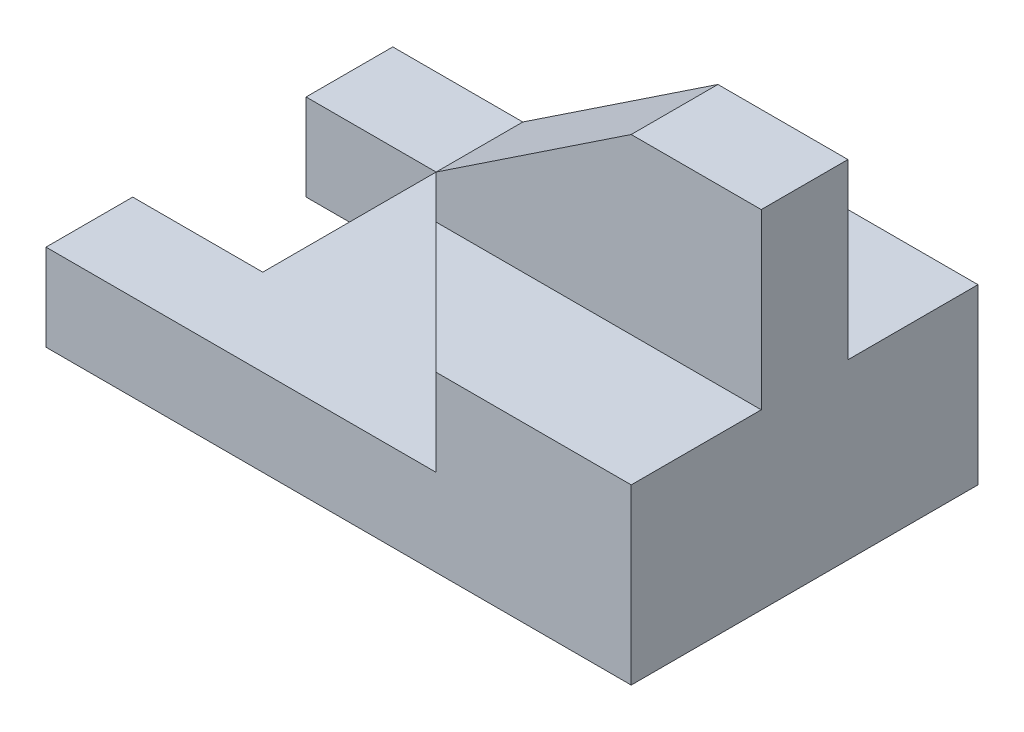
ISO-10303-21;
HEADER;
FILE_DESCRIPTION(('STEP AP214'),'2;1');
FILE_NAME('part.step','',(''),(''),'','','');
FILE_SCHEMA(('AUTOMOTIVE_DESIGN { 1 0 10303 214 1 1 1 1 }'));
ENDSEC;
DATA;
#1=APPLICATION_CONTEXT('core data for automotive mechanical design processes');
#2=APPLICATION_PROTOCOL_DEFINITION('international standard','automotive_design',2000,#1);
#3=PRODUCT_CONTEXT('',#1,'mechanical');
#4=PRODUCT('Part','Part','',(#3));
#5=PRODUCT_RELATED_PRODUCT_CATEGORY('part','',(#4));
#6=PRODUCT_DEFINITION_FORMATION('','',#4);
#7=PRODUCT_DEFINITION_CONTEXT('part definition',#1,'design');
#8=PRODUCT_DEFINITION('design','',#6,#7);
#9=PRODUCT_DEFINITION_SHAPE('','',#8);
#10=(LENGTH_UNIT() NAMED_UNIT(*) SI_UNIT(.MILLI.,.METRE.));
#11=(NAMED_UNIT(*) PLANE_ANGLE_UNIT() SI_UNIT($,.RADIAN.));
#12=(NAMED_UNIT(*) SI_UNIT($,.STERADIAN.) SOLID_ANGLE_UNIT());
#13=UNCERTAINTY_MEASURE_WITH_UNIT(LENGTH_MEASURE(1.E-05),#10,'distance_accuracy_value','');
#14=(GEOMETRIC_REPRESENTATION_CONTEXT(3) GLOBAL_UNCERTAINTY_ASSIGNED_CONTEXT((#13)) GLOBAL_UNIT_ASSIGNED_CONTEXT((#10,
#11,#12)) REPRESENTATION_CONTEXT('',''));
#15=CARTESIAN_POINT('',(0.,0.,0.));
#16=DIRECTION('',(0.,0.,1.));
#17=DIRECTION('',(1.,0.,0.));
#18=AXIS2_PLACEMENT_3D('',#15,#16,#17);
#19=CARTESIAN_POINT('',(0.,4.,0.));
#20=DIRECTION('',(0.,1.,0.));
#21=DIRECTION('',(0.,0.,1.));
#22=AXIS2_PLACEMENT_3D('',#19,#20,#21);
#23=PLANE('',#22);
#24=DIRECTION('',(-0.707106781186547,0.,0.707106781186548));
#25=VECTOR('',#24,1.);
#26=CARTESIAN_POINT('',(2.25,4.,-4.));
#27=LINE('',#26,#25);
#28=CARTESIAN_POINT('',(2.25,4.,-4.));
#29=VERTEX_POINT('',#28);
#30=CARTESIAN_POINT('',(-0.749999999999999,4.,-1.));
#31=VERTEX_POINT('',#30);
#32=EDGE_CURVE('E200',#29,#31,#27,.T.);
#33=ORIENTED_EDGE('',*,*,#32,.T.);
#34=DIRECTION('',(1.,0.,0.));
#35=VECTOR('',#34,1.);
#36=CARTESIAN_POINT('',(6.75,4.,-1.));
#37=LINE('',#36,#35);
#38=CARTESIAN_POINT('',(6.75,4.,-1.));
#39=VERTEX_POINT('',#38);
#40=EDGE_CURVE('E50',#31,#39,#37,.T.);
#41=ORIENTED_EDGE('',*,*,#40,.T.);
#42=DIRECTION('',(0.,0.,-1.));
#43=VECTOR('',#42,1.);
#44=CARTESIAN_POINT('',(6.75,4.,4.));
#45=LINE('',#44,#43);
#46=CARTESIAN_POINT('',(6.75,4.,-4.));
#47=VERTEX_POINT('',#46);
#48=EDGE_CURVE('E159',#39,#47,#45,.T.);
#49=ORIENTED_EDGE('',*,*,#48,.T.);
#50=DIRECTION('',(-1.,0.,0.));
#51=VECTOR('',#50,1.);
#52=CARTESIAN_POINT('',(6.75,4.,-4.));
#53=LINE('',#52,#51);
#54=EDGE_CURVE('E158',#47,#29,#53,.T.);
#55=ORIENTED_EDGE('',*,*,#54,.T.);
#56=EDGE_LOOP('',(#33,#41,#49,#55));
#57=FACE_BOUND('',#56,.T.);
#58=ADVANCED_FACE('F35',(#57),#23,.T.);
#59=CARTESIAN_POINT('',(0.,2.,-2.));
#60=DIRECTION('',(0.,0.,-1.));
#61=DIRECTION('',(-1.,0.,0.));
#62=AXIS2_PLACEMENT_3D('',#59,#60,#61);
#63=PLANE('',#62);
#64=DIRECTION('',(1.,0.,0.));
#65=VECTOR('',#64,1.);
#66=CARTESIAN_POINT('',(0.,0.,-2.));
#67=LINE('',#66,#65);
#68=CARTESIAN_POINT('',(-6.75,0.,-2.));
#69=VERTEX_POINT('',#68);
#70=CARTESIAN_POINT('',(-3.75,0.,-2.));
#71=VERTEX_POINT('',#70);
#72=EDGE_CURVE('E222',#69,#71,#67,.T.);
#73=ORIENTED_EDGE('',*,*,#72,.T.);
#74=DIRECTION('',(0.,-1.,0.));
#75=VECTOR('',#74,1.);
#76=CARTESIAN_POINT('',(-3.75,2.,-2.));
#77=LINE('',#76,#75);
#78=CARTESIAN_POINT('',(-3.75,2.,-2.));
#79=VERTEX_POINT('',#78);
#80=EDGE_CURVE('E11',#79,#71,#77,.T.);
#81=ORIENTED_EDGE('',*,*,#80,.F.);
#82=DIRECTION('',(1.,0.,0.));
#83=VECTOR('',#82,1.);
#84=CARTESIAN_POINT('',(0.,2.,-2.));
#85=LINE('',#84,#83);
#86=CARTESIAN_POINT('',(-6.75,2.,-2.));
#87=VERTEX_POINT('',#86);
#88=EDGE_CURVE('E223',#87,#79,#85,.T.);
#89=ORIENTED_EDGE('',*,*,#88,.F.);
#90=DIRECTION('',(0.,-1.,0.));
#91=VECTOR('',#90,1.);
#92=CARTESIAN_POINT('',(-6.75,2.,-2.));
#93=LINE('',#92,#91);
#94=EDGE_CURVE('E259',#87,#69,#93,.T.);
#95=ORIENTED_EDGE('',*,*,#94,.T.);
#96=EDGE_LOOP('',(#73,#81,#89,#95));
#97=FACE_BOUND('',#96,.T.);
#98=ADVANCED_FACE('F37',(#97),#63,.F.);
#99=CARTESIAN_POINT('',(-3.75,2.,0.));
#100=DIRECTION('',(1.,0.,0.));
#101=DIRECTION('',(0.,0.,-1.));
#102=AXIS2_PLACEMENT_3D('',#99,#100,#101);
#103=PLANE('',#102);
#104=DIRECTION('',(0.,0.,1.));
#105=VECTOR('',#104,1.);
#106=CARTESIAN_POINT('',(-3.75,0.,0.));
#107=LINE('',#106,#105);
#108=CARTESIAN_POINT('',(-3.75,0.,2.));
#109=VERTEX_POINT('',#108);
#110=EDGE_CURVE('E243',#71,#109,#107,.T.);
#111=ORIENTED_EDGE('',*,*,#110,.T.);
#112=DIRECTION('',(0.,-1.,0.));
#113=VECTOR('',#112,1.);
#114=CARTESIAN_POINT('',(-3.75,2.,2.));
#115=LINE('',#114,#113);
#116=CARTESIAN_POINT('',(-3.75,2.,2.));
#117=VERTEX_POINT('',#116);
#118=EDGE_CURVE('E43',#117,#109,#115,.T.);
#119=ORIENTED_EDGE('',*,*,#118,.F.);
#120=DIRECTION('',(0.,0.,1.));
#121=VECTOR('',#120,1.);
#122=CARTESIAN_POINT('',(-3.75,2.,0.));
#123=LINE('',#122,#121);
#124=EDGE_CURVE('E226',#79,#117,#123,.T.);
#125=ORIENTED_EDGE('',*,*,#124,.F.);
#126=ORIENTED_EDGE('',*,*,#80,.T.);
#127=EDGE_LOOP('',(#111,#119,#125,#126));
#128=FACE_BOUND('',#127,.T.);
#129=ADVANCED_FACE('F276',(#128),#103,.F.);
#130=CARTESIAN_POINT('',(0.,2.,2.));
#131=DIRECTION('',(0.,0.,-1.));
#132=DIRECTION('',(-1.,0.,0.));
#133=AXIS2_PLACEMENT_3D('',#130,#131,#132);
#134=PLANE('',#133);
#135=DIRECTION('',(1.,0.,0.));
#136=VECTOR('',#135,1.);
#137=CARTESIAN_POINT('',(0.,0.,2.));
#138=LINE('',#137,#136);
#139=CARTESIAN_POINT('',(-6.75,0.,2.));
#140=VERTEX_POINT('',#139);
#141=EDGE_CURVE('E246',#140,#109,#138,.T.);
#142=ORIENTED_EDGE('',*,*,#141,.F.);
#143=DIRECTION('',(0.,-1.,0.));
#144=VECTOR('',#143,1.);
#145=CARTESIAN_POINT('',(-6.75,2.,2.));
#146=LINE('',#145,#144);
#147=CARTESIAN_POINT('',(-6.75,2.,2.));
#148=VERTEX_POINT('',#147);
#149=EDGE_CURVE('E269',#148,#140,#146,.T.);
#150=ORIENTED_EDGE('',*,*,#149,.F.);
#151=DIRECTION('',(1.,0.,0.));
#152=VECTOR('',#151,1.);
#153=CARTESIAN_POINT('',(0.,2.,2.));
#154=LINE('',#153,#152);
#155=EDGE_CURVE('E229',#148,#117,#154,.T.);
#156=ORIENTED_EDGE('',*,*,#155,.T.);
#157=ORIENTED_EDGE('',*,*,#118,.T.);
#158=EDGE_LOOP('',(#142,#150,#156,#157));
#159=FACE_BOUND('',#158,.T.);
#160=ADVANCED_FACE('F273',(#159),#134,.T.);
#161=CARTESIAN_POINT('',(-6.75,2.,0.));
#162=DIRECTION('',(-1.,0.,0.));
#163=DIRECTION('',(0.,0.,1.));
#164=AXIS2_PLACEMENT_3D('',#161,#162,#163);
#165=PLANE('',#164);
#166=DIRECTION('',(0.,0.,-1.));
#167=VECTOR('',#166,1.);
#168=CARTESIAN_POINT('',(-6.75,0.,0.));
#169=LINE('',#168,#167);
#170=CARTESIAN_POINT('',(-6.75,0.,4.));
#171=VERTEX_POINT('',#170);
#172=EDGE_CURVE('E249',#171,#140,#169,.T.);
#173=ORIENTED_EDGE('',*,*,#172,.F.);
#174=DIRECTION('',(0.,-1.,0.));
#175=VECTOR('',#174,1.);
#176=CARTESIAN_POINT('',(-6.75,2.,4.));
#177=LINE('',#176,#175);
#178=CARTESIAN_POINT('',(-6.75,2.,4.));
#179=VERTEX_POINT('',#178);
#180=EDGE_CURVE('E267',#179,#171,#177,.T.);
#181=ORIENTED_EDGE('',*,*,#180,.F.);
#182=DIRECTION('',(0.,0.,-1.));
#183=VECTOR('',#182,1.);
#184=CARTESIAN_POINT('',(-6.75,2.,0.));
#185=LINE('',#184,#183);
#186=EDGE_CURVE('E232',#179,#148,#185,.T.);
#187=ORIENTED_EDGE('',*,*,#186,.T.);
#188=ORIENTED_EDGE('',*,*,#149,.T.);
#189=EDGE_LOOP('',(#173,#181,#187,#188));
#190=FACE_BOUND('',#189,.T.);
#191=ADVANCED_FACE('F285',(#190),#165,.T.);
#192=CARTESIAN_POINT('',(0.,2.,4.));
#193=DIRECTION('',(0.,0.,-1.));
#194=DIRECTION('',(-1.,0.,0.));
#195=AXIS2_PLACEMENT_3D('',#192,#193,#194);
#196=PLANE('',#195);
#197=DIRECTION('',(1.,0.,0.));
#198=VECTOR('',#197,1.);
#199=CARTESIAN_POINT('',(0.,0.,4.));
#200=LINE('',#199,#198);
#201=CARTESIAN_POINT('',(6.75,0.,4.));
#202=VERTEX_POINT('',#201);
#203=EDGE_CURVE('E252',#171,#202,#200,.T.);
#204=ORIENTED_EDGE('',*,*,#203,.T.);
#205=DIRECTION('',(0.,-1.,0.));
#206=VECTOR('',#205,1.);
#207=CARTESIAN_POINT('',(6.75,2.,4.));
#208=LINE('',#207,#206);
#209=CARTESIAN_POINT('',(6.75,4.,4.));
#210=VERTEX_POINT('',#209);
#211=EDGE_CURVE('E265',#210,#202,#208,.T.);
#212=ORIENTED_EDGE('',*,*,#211,.F.);
#213=DIRECTION('',(1.,0.,0.));
#214=VECTOR('',#213,1.);
#215=CARTESIAN_POINT('',(2.25,4.,4.));
#216=LINE('',#215,#214);
#217=CARTESIAN_POINT('',(2.25,4.,4.));
#218=VERTEX_POINT('',#217);
#219=EDGE_CURVE('E154',#218,#210,#216,.T.);
#220=ORIENTED_EDGE('',*,*,#219,.F.);
#221=DIRECTION('',(0.,-1.,0.));
#222=VECTOR('',#221,1.);
#223=CARTESIAN_POINT('',(2.25,4.,4.));
#224=LINE('',#223,#222);
#225=CARTESIAN_POINT('',(2.25,2.,4.));
#226=VERTEX_POINT('',#225);
#227=EDGE_CURVE('E205',#218,#226,#224,.T.);
#228=ORIENTED_EDGE('',*,*,#227,.T.);
#229=DIRECTION('',(1.,0.,0.));
#230=VECTOR('',#229,1.);
#231=CARTESIAN_POINT('',(0.,2.,4.));
#232=LINE('',#231,#230);
#233=EDGE_CURVE('E235',#179,#226,#232,.T.);
#234=ORIENTED_EDGE('',*,*,#233,.F.);
#235=ORIENTED_EDGE('',*,*,#180,.T.);
#236=EDGE_LOOP('',(#204,#212,#220,#228,#234,#235));
#237=FACE_BOUND('',#236,.T.);
#238=ADVANCED_FACE('F304',(#237),#196,.F.);
#239=CARTESIAN_POINT('',(6.75,2.,0.));
#240=DIRECTION('',(-1.,0.,0.));
#241=DIRECTION('',(0.,0.,1.));
#242=AXIS2_PLACEMENT_3D('',#239,#240,#241);
#243=PLANE('',#242);
#244=DIRECTION('',(0.,0.,-1.));
#245=VECTOR('',#244,1.);
#246=CARTESIAN_POINT('',(6.75,0.,0.));
#247=LINE('',#246,#245);
#248=CARTESIAN_POINT('',(6.75,0.,-4.));
#249=VERTEX_POINT('',#248);
#250=EDGE_CURVE('E254',#202,#249,#247,.T.);
#251=ORIENTED_EDGE('',*,*,#250,.T.);
#252=DIRECTION('',(0.,-1.,0.));
#253=VECTOR('',#252,1.);
#254=CARTESIAN_POINT('',(6.75,2.,-4.));
#255=LINE('',#254,#253);
#256=EDGE_CURVE('E263',#47,#249,#255,.T.);
#257=ORIENTED_EDGE('',*,*,#256,.F.);
#258=ORIENTED_EDGE('',*,*,#48,.F.);
#259=DIRECTION('',(0.,1.,0.));
#260=VECTOR('',#259,1.);
#261=CARTESIAN_POINT('',(6.75,8.,-1.));
#262=LINE('',#261,#260);
#263=CARTESIAN_POINT('',(6.75,8.,-1.));
#264=VERTEX_POINT('',#263);
#265=EDGE_CURVE('E186',#39,#264,#262,.T.);
#266=ORIENTED_EDGE('',*,*,#265,.T.);
#267=DIRECTION('',(0.,0.,-1.));
#268=VECTOR('',#267,1.);
#269=CARTESIAN_POINT('',(6.75,8.,1.));
#270=LINE('',#269,#268);
#271=CARTESIAN_POINT('',(6.75,8.,1.));
#272=VERTEX_POINT('',#271);
#273=EDGE_CURVE('E172',#272,#264,#270,.T.);
#274=ORIENTED_EDGE('',*,*,#273,.F.);
#275=DIRECTION('',(0.,1.,0.));
#276=VECTOR('',#275,1.);
#277=CARTESIAN_POINT('',(6.75,8.,1.));
#278=LINE('',#277,#276);
#279=CARTESIAN_POINT('',(6.75,4.,1.));
#280=VERTEX_POINT('',#279);
#281=EDGE_CURVE('E164',#280,#272,#278,.T.);
#282=ORIENTED_EDGE('',*,*,#281,.F.);
#283=EDGE_CURVE('E148',#210,#280,#45,.T.);
#284=ORIENTED_EDGE('',*,*,#283,.F.);
#285=ORIENTED_EDGE('',*,*,#211,.T.);
#286=EDGE_LOOP('',(#251,#257,#258,#266,#274,#282,#284,#285));
#287=FACE_BOUND('',#286,.T.);
#288=ADVANCED_FACE('F170',(#287),#243,.F.);
#289=CARTESIAN_POINT('',(0.,2.,-4.));
#290=DIRECTION('',(0.,0.,-1.));
#291=DIRECTION('',(-1.,0.,0.));
#292=AXIS2_PLACEMENT_3D('',#289,#290,#291);
#293=PLANE('',#292);
#294=DIRECTION('',(1.,0.,0.));
#295=VECTOR('',#294,1.);
#296=CARTESIAN_POINT('',(0.,0.,-4.));
#297=LINE('',#296,#295);
#298=CARTESIAN_POINT('',(-6.75,0.,-4.));
#299=VERTEX_POINT('',#298);
#300=EDGE_CURVE('E256',#299,#249,#297,.T.);
#301=ORIENTED_EDGE('',*,*,#300,.F.);
#302=DIRECTION('',(0.,-1.,0.));
#303=VECTOR('',#302,1.);
#304=CARTESIAN_POINT('',(-6.75,2.,-4.));
#305=LINE('',#304,#303);
#306=CARTESIAN_POINT('',(-6.75,2.,-4.));
#307=VERTEX_POINT('',#306);
#308=EDGE_CURVE('E261',#307,#299,#305,.T.);
#309=ORIENTED_EDGE('',*,*,#308,.F.);
#310=DIRECTION('',(1.,0.,0.));
#311=VECTOR('',#310,1.);
#312=CARTESIAN_POINT('',(0.,2.,-4.));
#313=LINE('',#312,#311);
#314=CARTESIAN_POINT('',(2.25,2.,-4.));
#315=VERTEX_POINT('',#314);
#316=EDGE_CURVE('E238',#307,#315,#313,.T.);
#317=ORIENTED_EDGE('',*,*,#316,.T.);
#318=DIRECTION('',(0.,-1.,0.));
#319=VECTOR('',#318,1.);
#320=CARTESIAN_POINT('',(2.25,4.,-4.));
#321=LINE('',#320,#319);
#322=EDGE_CURVE('E219',#29,#315,#321,.T.);
#323=ORIENTED_EDGE('',*,*,#322,.F.);
#324=ORIENTED_EDGE('',*,*,#54,.F.);
#325=ORIENTED_EDGE('',*,*,#256,.T.);
#326=EDGE_LOOP('',(#301,#309,#317,#323,#324,#325));
#327=FACE_BOUND('',#326,.T.);
#328=ADVANCED_FACE('F300',(#327),#293,.T.);
#329=EDGE_CURVE('E227',#69,#299,#169,.T.);
#330=ORIENTED_EDGE('',*,*,#329,.F.);
#331=ORIENTED_EDGE('',*,*,#94,.F.);
#332=EDGE_CURVE('E236',#87,#307,#185,.T.);
#333=ORIENTED_EDGE('',*,*,#332,.T.);
#334=ORIENTED_EDGE('',*,*,#308,.T.);
#335=EDGE_LOOP('',(#330,#331,#333,#334));
#336=FACE_BOUND('',#335,.T.);
#337=ADVANCED_FACE('F297',(#336),#165,.T.);
#338=CARTESIAN_POINT('',(0.,2.,0.));
#339=DIRECTION('',(0.,1.,0.));
#340=DIRECTION('',(0.,0.,1.));
#341=AXIS2_PLACEMENT_3D('',#338,#339,#340);
#342=PLANE('',#341);
#343=DIRECTION('',(0.707106781186547,0.,0.707106781186548));
#344=VECTOR('',#343,1.);
#345=CARTESIAN_POINT('',(-0.749999999999999,2.,0.999999999999999));
#346=LINE('',#345,#344);
#347=CARTESIAN_POINT('',(-0.749999999999999,2.,0.999999999999999));
#348=VERTEX_POINT('',#347);
#349=EDGE_CURVE('E58',#348,#226,#346,.T.);
#350=ORIENTED_EDGE('',*,*,#349,.F.);
#351=DIRECTION('',(0.,0.,1.));
#352=VECTOR('',#351,1.);
#353=CARTESIAN_POINT('',(-0.749999999999999,2.,-1.));
#354=LINE('',#353,#352);
#355=CARTESIAN_POINT('',(-0.749999999999999,2.,-1.));
#356=VERTEX_POINT('',#355);
#357=EDGE_CURVE('E208',#356,#348,#354,.T.);
#358=ORIENTED_EDGE('',*,*,#357,.F.);
#359=DIRECTION('',(-0.707106781186547,0.,0.707106781186548));
#360=VECTOR('',#359,1.);
#361=CARTESIAN_POINT('',(2.25,2.,-4.));
#362=LINE('',#361,#360);
#363=EDGE_CURVE('E197',#315,#356,#362,.T.);
#364=ORIENTED_EDGE('',*,*,#363,.F.);
#365=ORIENTED_EDGE('',*,*,#316,.F.);
#366=ORIENTED_EDGE('',*,*,#332,.F.);
#367=ORIENTED_EDGE('',*,*,#88,.T.);
#368=ORIENTED_EDGE('',*,*,#124,.T.);
#369=ORIENTED_EDGE('',*,*,#155,.F.);
#370=ORIENTED_EDGE('',*,*,#186,.F.);
#371=ORIENTED_EDGE('',*,*,#233,.T.);
#372=EDGE_LOOP('',(#350,#358,#364,#365,#366,#367,#368,#369,#370,#371));
#373=FACE_BOUND('',#372,.T.);
#374=ADVANCED_FACE('F288',(#373),#342,.T.);
#375=CARTESIAN_POINT('',(0.,0.,0.));
#376=DIRECTION('',(0.,1.,0.));
#377=DIRECTION('',(0.,0.,1.));
#378=AXIS2_PLACEMENT_3D('',#375,#376,#377);
#379=PLANE('',#378);
#380=ORIENTED_EDGE('',*,*,#72,.F.);
#381=ORIENTED_EDGE('',*,*,#329,.T.);
#382=ORIENTED_EDGE('',*,*,#300,.T.);
#383=ORIENTED_EDGE('',*,*,#250,.F.);
#384=ORIENTED_EDGE('',*,*,#203,.F.);
#385=ORIENTED_EDGE('',*,*,#172,.T.);
#386=ORIENTED_EDGE('',*,*,#141,.T.);
#387=ORIENTED_EDGE('',*,*,#110,.F.);
#388=EDGE_LOOP('',(#380,#381,#382,#383,#384,#385,#386,#387));
#389=FACE_BOUND('',#388,.T.);
#390=ADVANCED_FACE('F280',(#389),#379,.F.);
#391=CARTESIAN_POINT('',(2.25,4.,-4.));
#392=DIRECTION('',(0.707106781186548,0.,0.707106781186547));
#393=DIRECTION('',(0.707106781186547,0.,-0.707106781186548));
#394=AXIS2_PLACEMENT_3D('',#391,#392,#393);
#395=PLANE('',#394);
#396=ORIENTED_EDGE('',*,*,#363,.T.);
#397=DIRECTION('',(0.,-1.,0.));
#398=VECTOR('',#397,1.);
#399=CARTESIAN_POINT('',(-0.749999999999999,4.,-1.));
#400=LINE('',#399,#398);
#401=EDGE_CURVE('E216',#31,#356,#400,.T.);
#402=ORIENTED_EDGE('',*,*,#401,.F.);
#403=ORIENTED_EDGE('',*,*,#32,.F.);
#404=ORIENTED_EDGE('',*,*,#322,.T.);
#405=EDGE_LOOP('',(#396,#402,#403,#404));
#406=FACE_BOUND('',#405,.T.);
#407=ADVANCED_FACE('F313',(#406),#395,.F.);
#408=CARTESIAN_POINT('',(-0.749999999999999,4.,-1.));
#409=DIRECTION('',(1.,0.,0.));
#410=DIRECTION('',(0.,0.,-1.));
#411=AXIS2_PLACEMENT_3D('',#408,#409,#410);
#412=PLANE('',#411);
#413=ORIENTED_EDGE('',*,*,#357,.T.);
#414=DIRECTION('',(0.,-1.,0.));
#415=VECTOR('',#414,1.);
#416=CARTESIAN_POINT('',(-0.749999999999999,4.,0.999999999999999));
#417=LINE('',#416,#415);
#418=CARTESIAN_POINT('',(-0.749999999999999,4.,0.999999999999999));
#419=VERTEX_POINT('',#418);
#420=EDGE_CURVE('E213',#419,#348,#417,.T.);
#421=ORIENTED_EDGE('',*,*,#420,.F.);
#422=DIRECTION('',(0.,-1.,0.));
#423=VECTOR('',#422,1.);
#424=CARTESIAN_POINT('',(-0.749999999999999,4.,1.));
#425=LINE('',#424,#423);
#426=CARTESIAN_POINT('',(-0.749999999999999,5.,1.));
#427=VERTEX_POINT('',#426);
#428=EDGE_CURVE('E167',#427,#419,#425,.T.);
#429=ORIENTED_EDGE('',*,*,#428,.F.);
#430=DIRECTION('',(0.,0.,-1.));
#431=VECTOR('',#430,1.);
#432=CARTESIAN_POINT('',(-0.749999999999999,5.,1.));
#433=LINE('',#432,#431);
#434=CARTESIAN_POINT('',(-0.749999999999999,5.,-1.));
#435=VERTEX_POINT('',#434);
#436=EDGE_CURVE('E181',#427,#435,#433,.T.);
#437=ORIENTED_EDGE('',*,*,#436,.T.);
#438=DIRECTION('',(0.,-1.,0.));
#439=VECTOR('',#438,1.);
#440=CARTESIAN_POINT('',(-0.749999999999999,4.,-1.));
#441=LINE('',#440,#439);
#442=EDGE_CURVE('E182',#435,#31,#441,.T.);
#443=ORIENTED_EDGE('',*,*,#442,.T.);
#444=ORIENTED_EDGE('',*,*,#401,.T.);
#445=EDGE_LOOP('',(#413,#421,#429,#437,#443,#444));
#446=FACE_BOUND('',#445,.T.);
#447=ADVANCED_FACE('F310',(#446),#412,.F.);
#448=CARTESIAN_POINT('',(-0.749999999999999,4.,0.999999999999999));
#449=DIRECTION('',(0.707106781186548,0.,-0.707106781186547));
#450=DIRECTION('',(-0.707106781186547,0.,-0.707106781186548));
#451=AXIS2_PLACEMENT_3D('',#448,#449,#450);
#452=PLANE('',#451);
#453=ORIENTED_EDGE('',*,*,#349,.T.);
#454=ORIENTED_EDGE('',*,*,#227,.F.);
#455=DIRECTION('',(0.707106781186547,0.,0.707106781186548));
#456=VECTOR('',#455,1.);
#457=CARTESIAN_POINT('',(-0.749999999999999,4.,0.999999999999999));
#458=LINE('',#457,#456);
#459=EDGE_CURVE('E202',#419,#218,#458,.T.);
#460=ORIENTED_EDGE('',*,*,#459,.F.);
#461=ORIENTED_EDGE('',*,*,#420,.T.);
#462=EDGE_LOOP('',(#453,#454,#460,#461));
#463=FACE_BOUND('',#462,.T.);
#464=ADVANCED_FACE('F307',(#463),#452,.F.);
#465=DIRECTION('',(1.,0.,0.));
#466=VECTOR('',#465,1.);
#467=CARTESIAN_POINT('',(6.75,4.,1.));
#468=LINE('',#467,#466);
#469=EDGE_CURVE('E151',#419,#280,#468,.T.);
#470=ORIENTED_EDGE('',*,*,#469,.F.);
#471=ORIENTED_EDGE('',*,*,#459,.T.);
#472=ORIENTED_EDGE('',*,*,#219,.T.);
#473=ORIENTED_EDGE('',*,*,#283,.T.);
#474=EDGE_LOOP('',(#470,#471,#472,#473));
#475=FACE_BOUND('',#474,.T.);
#476=ADVANCED_FACE('F150',(#475),#23,.T.);
#477=CARTESIAN_POINT('',(3.75,8.,1.));
#478=DIRECTION('',(0.,-1.,0.));
#479=DIRECTION('',(0.,0.,-1.));
#480=AXIS2_PLACEMENT_3D('',#477,#478,#479);
#481=PLANE('',#480);
#482=DIRECTION('',(-1.,0.,0.));
#483=VECTOR('',#482,1.);
#484=CARTESIAN_POINT('',(3.75,8.,-1.));
#485=LINE('',#484,#483);
#486=CARTESIAN_POINT('',(3.75,8.,-1.));
#487=VERTEX_POINT('',#486);
#488=EDGE_CURVE('E188',#264,#487,#485,.T.);
#489=ORIENTED_EDGE('',*,*,#488,.T.);
#490=DIRECTION('',(0.,0.,-1.));
#491=VECTOR('',#490,1.);
#492=CARTESIAN_POINT('',(3.75,8.,1.));
#493=LINE('',#492,#491);
#494=CARTESIAN_POINT('',(3.75,8.,1.));
#495=VERTEX_POINT('',#494);
#496=EDGE_CURVE('E194',#495,#487,#493,.T.);
#497=ORIENTED_EDGE('',*,*,#496,.F.);
#498=DIRECTION('',(-1.,0.,0.));
#499=VECTOR('',#498,1.);
#500=CARTESIAN_POINT('',(3.75,8.,1.));
#501=LINE('',#500,#499);
#502=EDGE_CURVE('E174',#272,#495,#501,.T.);
#503=ORIENTED_EDGE('',*,*,#502,.F.);
#504=ORIENTED_EDGE('',*,*,#273,.T.);
#505=EDGE_LOOP('',(#489,#497,#503,#504));
#506=FACE_BOUND('',#505,.T.);
#507=ADVANCED_FACE('F324',(#506),#481,.F.);
#508=CARTESIAN_POINT('',(-0.749999999999999,5.,1.));
#509=DIRECTION('',(0.554700196225229,-0.832050294337844,0.));
#510=DIRECTION('',(0.832050294337844,0.554700196225229,0.));
#511=AXIS2_PLACEMENT_3D('',#508,#509,#510);
#512=PLANE('',#511);
#513=DIRECTION('',(-0.832050294337844,-0.554700196225229,0.));
#514=VECTOR('',#513,1.);
#515=CARTESIAN_POINT('',(-0.749999999999999,5.,-1.));
#516=LINE('',#515,#514);
#517=EDGE_CURVE('E190',#487,#435,#516,.T.);
#518=ORIENTED_EDGE('',*,*,#517,.T.);
#519=ORIENTED_EDGE('',*,*,#436,.F.);
#520=DIRECTION('',(-0.832050294337844,-0.554700196225229,0.));
#521=VECTOR('',#520,1.);
#522=CARTESIAN_POINT('',(-0.749999999999999,5.,1.));
#523=LINE('',#522,#521);
#524=EDGE_CURVE('E176',#495,#427,#523,.T.);
#525=ORIENTED_EDGE('',*,*,#524,.F.);
#526=ORIENTED_EDGE('',*,*,#496,.T.);
#527=EDGE_LOOP('',(#518,#519,#525,#526));
#528=FACE_BOUND('',#527,.T.);
#529=ADVANCED_FACE('F327',(#528),#512,.F.);
#530=CARTESIAN_POINT('',(0.,0.,1.));
#531=DIRECTION('',(0.,0.,-1.));
#532=DIRECTION('',(-1.,0.,0.));
#533=AXIS2_PLACEMENT_3D('',#530,#531,#532);
#534=PLANE('',#533);
#535=ORIENTED_EDGE('',*,*,#428,.T.);
#536=ORIENTED_EDGE('',*,*,#469,.T.);
#537=ORIENTED_EDGE('',*,*,#281,.T.);
#538=ORIENTED_EDGE('',*,*,#502,.T.);
#539=ORIENTED_EDGE('',*,*,#524,.T.);
#540=EDGE_LOOP('',(#535,#536,#537,#538,#539));
#541=FACE_BOUND('',#540,.T.);
#542=ADVANCED_FACE('F163',(#541),#534,.F.);
#543=CARTESIAN_POINT('',(0.,0.,-1.));
#544=DIRECTION('',(0.,0.,-1.));
#545=DIRECTION('',(-1.,0.,0.));
#546=AXIS2_PLACEMENT_3D('',#543,#544,#545);
#547=PLANE('',#546);
#548=ORIENTED_EDGE('',*,*,#442,.F.);
#549=ORIENTED_EDGE('',*,*,#517,.F.);
#550=ORIENTED_EDGE('',*,*,#488,.F.);
#551=ORIENTED_EDGE('',*,*,#265,.F.);
#552=ORIENTED_EDGE('',*,*,#40,.F.);
#553=EDGE_LOOP('',(#548,#549,#550,#551,#552));
#554=FACE_BOUND('',#553,.T.);
#555=ADVANCED_FACE('F320',(#554),#547,.T.);
#556=CLOSED_SHELL('',(#58,#98,#129,#160,#191,#238,#288,#328,#337,#374,#390,#407,#447,#464,#476,
#507,#529,#542,#555));
#557=MANIFOLD_SOLID_BREP('B2',#556);
#558=ADVANCED_BREP_SHAPE_REPRESENTATION('',(#18,#557),#14);
#559=SHAPE_DEFINITION_REPRESENTATION(#9,#558);
ENDSEC;
END-ISO-10303-21;
